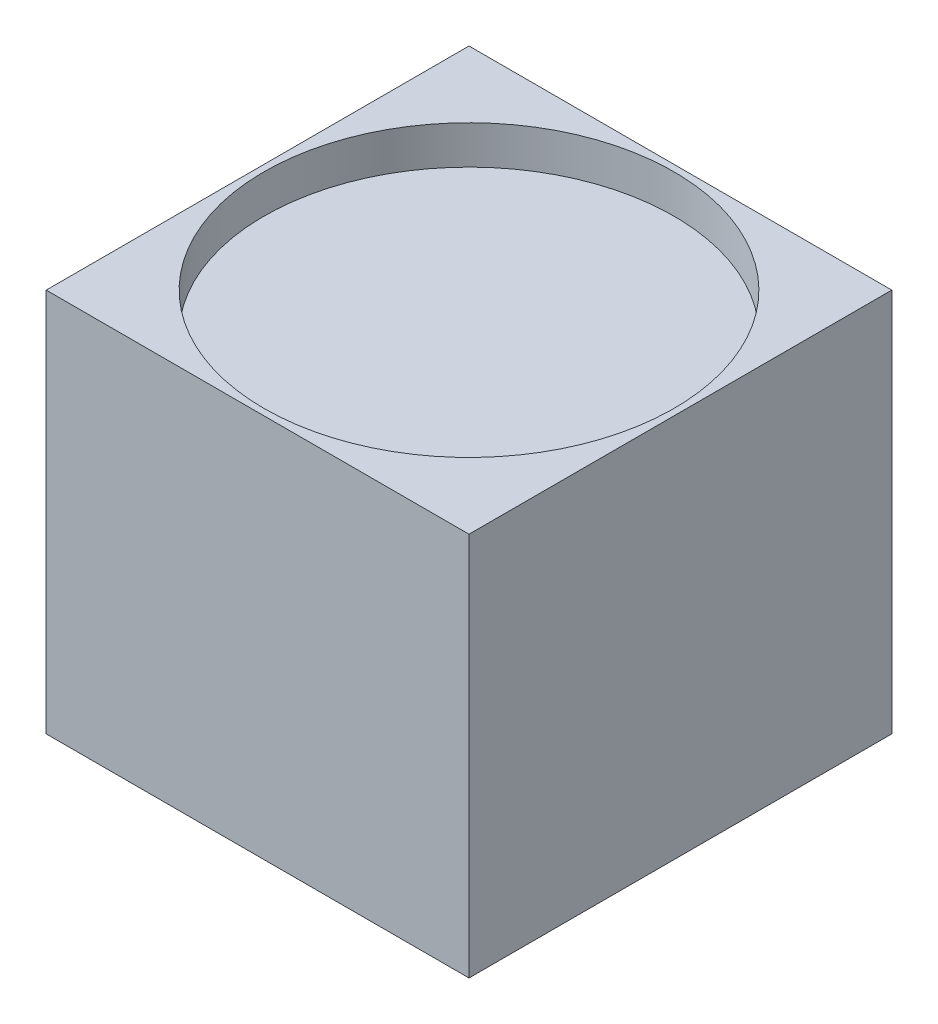
ISO-10303-21;
HEADER;
FILE_DESCRIPTION(('STEP AP214'),'2;1');
FILE_NAME('part.step','',(''),(''),'','','');
FILE_SCHEMA(('AUTOMOTIVE_DESIGN { 1 0 10303 214 1 1 1 1 }'));
ENDSEC;
DATA;
#1=APPLICATION_CONTEXT('core data for automotive mechanical design processes');
#2=APPLICATION_PROTOCOL_DEFINITION('international standard','automotive_design',2000,#1);
#3=PRODUCT_CONTEXT('',#1,'mechanical');
#4=PRODUCT('Part','Part','',(#3));
#5=PRODUCT_RELATED_PRODUCT_CATEGORY('part','',(#4));
#6=PRODUCT_DEFINITION_FORMATION('','',#4);
#7=PRODUCT_DEFINITION_CONTEXT('part definition',#1,'design');
#8=PRODUCT_DEFINITION('design','',#6,#7);
#9=PRODUCT_DEFINITION_SHAPE('','',#8);
#10=(LENGTH_UNIT() NAMED_UNIT(*) SI_UNIT(.MILLI.,.METRE.));
#11=(NAMED_UNIT(*) PLANE_ANGLE_UNIT() SI_UNIT($,.RADIAN.));
#12=(NAMED_UNIT(*) SI_UNIT($,.STERADIAN.) SOLID_ANGLE_UNIT());
#13=UNCERTAINTY_MEASURE_WITH_UNIT(LENGTH_MEASURE(1.E-05),#10,'distance_accuracy_value','');
#14=(GEOMETRIC_REPRESENTATION_CONTEXT(3) GLOBAL_UNCERTAINTY_ASSIGNED_CONTEXT((#13)) GLOBAL_UNIT_ASSIGNED_CONTEXT((#10,
#11,#12)) REPRESENTATION_CONTEXT('',''));
#15=CARTESIAN_POINT('',(0.,0.,0.));
#16=DIRECTION('',(0.,0.,1.));
#17=DIRECTION('',(1.,0.,0.));
#18=AXIS2_PLACEMENT_3D('',#15,#16,#17);
#19=CARTESIAN_POINT('',(16.5,30.,16.5));
#20=DIRECTION('',(-1.,0.,0.));
#21=DIRECTION('',(0.,0.,1.));
#22=AXIS2_PLACEMENT_3D('',#19,#20,#21);
#23=PLANE('',#22);
#24=DIRECTION('',(0.,0.,-1.));
#25=VECTOR('',#24,1.);
#26=CARTESIAN_POINT('',(16.5,0.,16.5));
#27=LINE('',#26,#25);
#28=CARTESIAN_POINT('',(16.5,0.,16.5));
#29=VERTEX_POINT('',#28);
#30=CARTESIAN_POINT('',(16.5,0.,-16.5));
#31=VERTEX_POINT('',#30);
#32=EDGE_CURVE('E100',#29,#31,#27,.T.);
#33=ORIENTED_EDGE('',*,*,#32,.T.);
#34=DIRECTION('',(0.,-1.,0.));
#35=VECTOR('',#34,1.);
#36=CARTESIAN_POINT('',(16.5,30.,-16.5));
#37=LINE('',#36,#35);
#38=CARTESIAN_POINT('',(16.5,30.,-16.5));
#39=VERTEX_POINT('',#38);
#40=EDGE_CURVE('E42',#39,#31,#37,.T.);
#41=ORIENTED_EDGE('',*,*,#40,.F.);
#42=DIRECTION('',(0.,0.,-1.));
#43=VECTOR('',#42,1.);
#44=CARTESIAN_POINT('',(16.5,30.,16.5));
#45=LINE('',#44,#43);
#46=CARTESIAN_POINT('',(16.5,30.,16.5));
#47=VERTEX_POINT('',#46);
#48=EDGE_CURVE('E86',#47,#39,#45,.T.);
#49=ORIENTED_EDGE('',*,*,#48,.F.);
#50=DIRECTION('',(0.,-1.,0.));
#51=VECTOR('',#50,1.);
#52=CARTESIAN_POINT('',(16.5,30.,16.5));
#53=LINE('',#52,#51);
#54=EDGE_CURVE('E96',#47,#29,#53,.T.);
#55=ORIENTED_EDGE('',*,*,#54,.T.);
#56=EDGE_LOOP('',(#33,#41,#49,#55));
#57=FACE_BOUND('',#56,.T.);
#58=ADVANCED_FACE('F33',(#57),#23,.F.);
#59=CARTESIAN_POINT('',(-16.5,30.,-16.5));
#60=DIRECTION('',(0.,0.,1.));
#61=DIRECTION('',(1.,0.,0.));
#62=AXIS2_PLACEMENT_3D('',#59,#60,#61);
#63=PLANE('',#62);
#64=DIRECTION('',(-1.,0.,0.));
#65=VECTOR('',#64,1.);
#66=CARTESIAN_POINT('',(-16.5,0.,-16.5));
#67=LINE('',#66,#65);
#68=CARTESIAN_POINT('',(-16.5,0.,-16.5));
#69=VERTEX_POINT('',#68);
#70=EDGE_CURVE('E91',#31,#69,#67,.T.);
#71=ORIENTED_EDGE('',*,*,#70,.T.);
#72=DIRECTION('',(0.,-1.,0.));
#73=VECTOR('',#72,1.);
#74=CARTESIAN_POINT('',(-16.5,30.,-16.5));
#75=LINE('',#74,#73);
#76=CARTESIAN_POINT('',(-16.5,30.,-16.5));
#77=VERTEX_POINT('',#76);
#78=EDGE_CURVE('E89',#77,#69,#75,.T.);
#79=ORIENTED_EDGE('',*,*,#78,.F.);
#80=DIRECTION('',(-1.,0.,0.));
#81=VECTOR('',#80,1.);
#82=CARTESIAN_POINT('',(-16.5,30.,-16.5));
#83=LINE('',#82,#81);
#84=EDGE_CURVE('E81',#39,#77,#83,.T.);
#85=ORIENTED_EDGE('',*,*,#84,.F.);
#86=ORIENTED_EDGE('',*,*,#40,.T.);
#87=EDGE_LOOP('',(#71,#79,#85,#86));
#88=FACE_BOUND('',#87,.T.);
#89=ADVANCED_FACE('F90',(#88),#63,.F.);
#90=CARTESIAN_POINT('',(-16.5,30.,16.5));
#91=DIRECTION('',(1.,0.,0.));
#92=DIRECTION('',(0.,0.,-1.));
#93=AXIS2_PLACEMENT_3D('',#90,#91,#92);
#94=PLANE('',#93);
#95=DIRECTION('',(0.,0.,1.));
#96=VECTOR('',#95,1.);
#97=CARTESIAN_POINT('',(-16.5,0.,16.5));
#98=LINE('',#97,#96);
#99=CARTESIAN_POINT('',(-16.5,0.,16.5));
#100=VERTEX_POINT('',#99);
#101=EDGE_CURVE('E67',#69,#100,#98,.T.);
#102=ORIENTED_EDGE('',*,*,#101,.T.);
#103=DIRECTION('',(0.,-1.,0.));
#104=VECTOR('',#103,1.);
#105=CARTESIAN_POINT('',(-16.5,30.,16.5));
#106=LINE('',#105,#104);
#107=CARTESIAN_POINT('',(-16.5,30.,16.5));
#108=VERTEX_POINT('',#107);
#109=EDGE_CURVE('E92',#108,#100,#106,.T.);
#110=ORIENTED_EDGE('',*,*,#109,.F.);
#111=DIRECTION('',(0.,0.,1.));
#112=VECTOR('',#111,1.);
#113=CARTESIAN_POINT('',(-16.5,30.,16.5));
#114=LINE('',#113,#112);
#115=EDGE_CURVE('E84',#77,#108,#114,.T.);
#116=ORIENTED_EDGE('',*,*,#115,.F.);
#117=ORIENTED_EDGE('',*,*,#78,.T.);
#118=EDGE_LOOP('',(#102,#110,#116,#117));
#119=FACE_BOUND('',#118,.T.);
#120=ADVANCED_FACE('F94',(#119),#94,.F.);
#121=CARTESIAN_POINT('',(-16.5,30.,16.5));
#122=DIRECTION('',(0.,0.,-1.));
#123=DIRECTION('',(-1.,0.,0.));
#124=AXIS2_PLACEMENT_3D('',#121,#122,#123);
#125=PLANE('',#124);
#126=DIRECTION('',(1.,0.,0.));
#127=VECTOR('',#126,1.);
#128=CARTESIAN_POINT('',(-16.5,0.,16.5));
#129=LINE('',#128,#127);
#130=EDGE_CURVE('E73',#100,#29,#129,.T.);
#131=ORIENTED_EDGE('',*,*,#130,.T.);
#132=ORIENTED_EDGE('',*,*,#54,.F.);
#133=DIRECTION('',(1.,0.,0.));
#134=VECTOR('',#133,1.);
#135=CARTESIAN_POINT('',(-16.5,30.,16.5));
#136=LINE('',#135,#134);
#137=EDGE_CURVE('E50',#108,#47,#136,.T.);
#138=ORIENTED_EDGE('',*,*,#137,.F.);
#139=ORIENTED_EDGE('',*,*,#109,.T.);
#140=EDGE_LOOP('',(#131,#132,#138,#139));
#141=FACE_BOUND('',#140,.T.);
#142=ADVANCED_FACE('F125',(#141),#125,.F.);
#143=CARTESIAN_POINT('',(0.,30.,0.));
#144=DIRECTION('',(0.,-1.,0.));
#145=DIRECTION('',(0.,0.,-1.));
#146=AXIS2_PLACEMENT_3D('',#143,#144,#145);
#147=PLANE('',#146);
#148=CARTESIAN_POINT('',(0.,30.,0.));
#149=DIRECTION('',(0.,1.,0.));
#150=DIRECTION('',(0.,0.,1.));
#151=AXIS2_PLACEMENT_3D('',#148,#149,#150);
#152=CIRCLE('',#151,16.);
#153=CARTESIAN_POINT('',(0.,30.,16.));
#154=VERTEX_POINT('',#153);
#155=EDGE_CURVE('E187',#154,#154,#152,.T.);
#156=ORIENTED_EDGE('',*,*,#155,.F.);
#157=EDGE_LOOP('',(#156));
#158=FACE_BOUND('',#157,.T.);
#159=ORIENTED_EDGE('',*,*,#48,.T.);
#160=ORIENTED_EDGE('',*,*,#84,.T.);
#161=ORIENTED_EDGE('',*,*,#115,.T.);
#162=ORIENTED_EDGE('',*,*,#137,.T.);
#163=EDGE_LOOP('',(#159,#160,#161,#162));
#164=FACE_BOUND('',#163,.T.);
#165=ADVANCED_FACE('F82',(#158,#164),#147,.F.);
#166=CARTESIAN_POINT('',(0.,0.,0.));
#167=DIRECTION('',(0.,-1.,0.));
#168=DIRECTION('',(0.,0.,-1.));
#169=AXIS2_PLACEMENT_3D('',#166,#167,#168);
#170=PLANE('',#169);
#171=CARTESIAN_POINT('',(0.,0.,0.));
#172=DIRECTION('',(0.,-1.,0.));
#173=DIRECTION('',(0.,0.,-1.));
#174=AXIS2_PLACEMENT_3D('',#171,#172,#173);
#175=CIRCLE('',#174,1.);
#176=CARTESIAN_POINT('',(0.,0.,-1.));
#177=VERTEX_POINT('',#176);
#178=EDGE_CURVE('E186',#177,#177,#175,.T.);
#179=ORIENTED_EDGE('',*,*,#178,.F.);
#180=EDGE_LOOP('',(#179));
#181=FACE_BOUND('',#180,.T.);
#182=ORIENTED_EDGE('',*,*,#32,.F.);
#183=ORIENTED_EDGE('',*,*,#130,.F.);
#184=ORIENTED_EDGE('',*,*,#101,.F.);
#185=ORIENTED_EDGE('',*,*,#70,.F.);
#186=EDGE_LOOP('',(#182,#183,#184,#185));
#187=FACE_BOUND('',#186,.T.);
#188=ADVANCED_FACE('F111',(#181,#187),#170,.T.);
#189=CARTESIAN_POINT('',(0.,27.,0.));
#190=DIRECTION('',(0.,1.,0.));
#191=DIRECTION('',(0.,0.,1.));
#192=AXIS2_PLACEMENT_3D('',#189,#190,#191);
#193=CYLINDRICAL_SURFACE('',#192,16.);
#194=CARTESIAN_POINT('',(0.,27.,0.));
#195=DIRECTION('',(0.,1.,0.));
#196=DIRECTION('',(0.,0.,1.));
#197=AXIS2_PLACEMENT_3D('',#194,#195,#196);
#198=CIRCLE('',#197,16.);
#199=CARTESIAN_POINT('',(0.,27.,16.));
#200=VERTEX_POINT('',#199);
#201=EDGE_CURVE('E103',#200,#200,#198,.T.);
#202=ORIENTED_EDGE('',*,*,#201,.F.);
#203=EDGE_LOOP('',(#202));
#204=FACE_BOUND('',#203,.T.);
#205=ORIENTED_EDGE('',*,*,#155,.T.);
#206=EDGE_LOOP('',(#205));
#207=FACE_BOUND('',#206,.T.);
#208=ADVANCED_FACE('F113',(#204,#207),#193,.F.);
#209=CARTESIAN_POINT('',(0.,27.,0.));
#210=DIRECTION('',(0.,1.,0.));
#211=DIRECTION('',(0.,0.,1.));
#212=AXIS2_PLACEMENT_3D('',#209,#210,#211);
#213=PLANE('',#212);
#214=ORIENTED_EDGE('',*,*,#201,.T.);
#215=EDGE_LOOP('',(#214));
#216=FACE_BOUND('',#215,.T.);
#217=ADVANCED_FACE('F121',(#216),#213,.T.);
#218=CARTESIAN_POINT('',(0.,2.,0.));
#219=DIRECTION('',(0.,-1.,0.));
#220=DIRECTION('',(0.,0.,-1.));
#221=AXIS2_PLACEMENT_3D('',#218,#219,#220);
#222=CYLINDRICAL_SURFACE('',#221,1.);
#223=CARTESIAN_POINT('',(0.,1.,0.));
#224=DIRECTION('',(0.,-1.,0.));
#225=DIRECTION('',(0.,0.,-1.));
#226=AXIS2_PLACEMENT_3D('',#223,#224,#225);
#227=CIRCLE('',#226,1.);
#228=CARTESIAN_POINT('',(0.,1.,-1.));
#229=VERTEX_POINT('',#228);
#230=EDGE_CURVE('E11',#229,#229,#227,.F.);
#231=ORIENTED_EDGE('',*,*,#230,.T.);
#232=EDGE_LOOP('',(#231));
#233=FACE_BOUND('',#232,.T.);
#234=ORIENTED_EDGE('',*,*,#178,.T.);
#235=EDGE_LOOP('',(#234));
#236=FACE_BOUND('',#235,.T.);
#237=ADVANCED_FACE('F159',(#233,#236),#222,.F.);
#238=CARTESIAN_POINT('',(0.,1.,0.));
#239=DIRECTION('',(0.,-1.,0.));
#240=DIRECTION('',(0.,0.,-1.));
#241=AXIS2_PLACEMENT_3D('',#238,#239,#240);
#242=SPHERICAL_SURFACE('',#241,1.);
#243=ORIENTED_EDGE('',*,*,#230,.F.);
#244=EDGE_LOOP('',(#243));
#245=FACE_BOUND('',#244,.T.);
#246=ADVANCED_FACE('F35',(#245),#242,.F.);
#247=CLOSED_SHELL('',(#58,#89,#120,#142,#165,#188,#208,#217,#237,#246));
#248=MANIFOLD_SOLID_BREP('B2',#247);
#249=ADVANCED_BREP_SHAPE_REPRESENTATION('',(#18,#248),#14);
#250=SHAPE_DEFINITION_REPRESENTATION(#9,#249);
ENDSEC;
END-ISO-10303-21;
